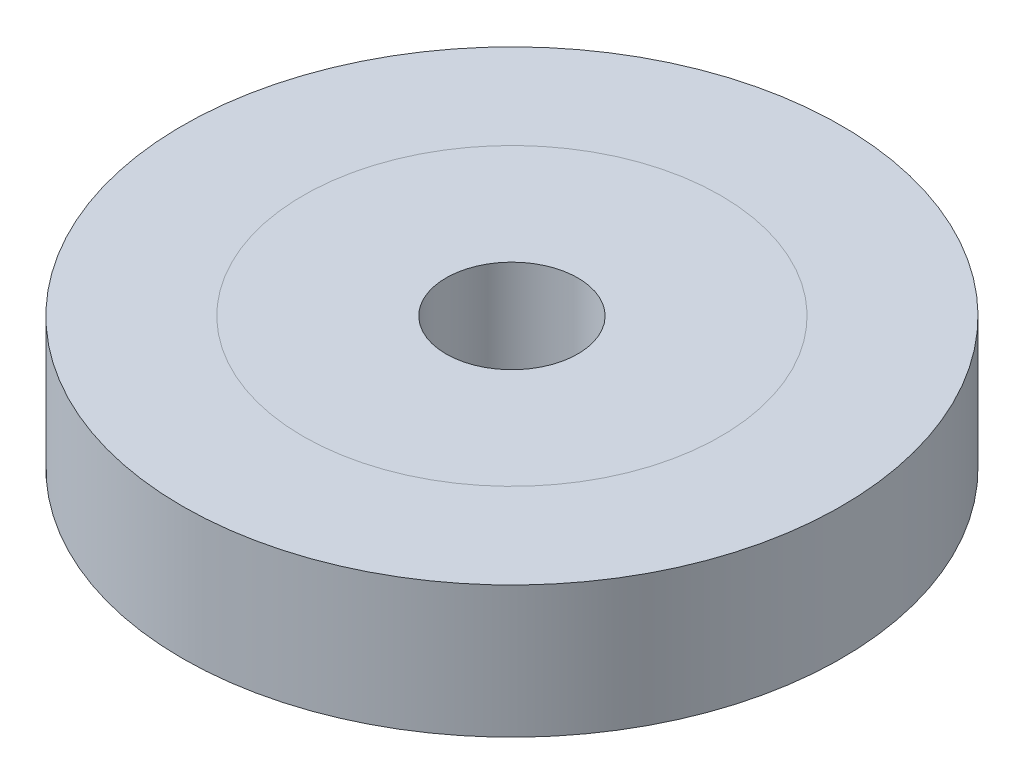
ISO-10303-21;
HEADER;
FILE_DESCRIPTION(('STEP AP214'),'2;1');
FILE_NAME('part.step','',(''),(''),'','','');
FILE_SCHEMA(('AUTOMOTIVE_DESIGN { 1 0 10303 214 1 1 1 1 }'));
ENDSEC;
DATA;
#1=APPLICATION_CONTEXT('core data for automotive mechanical design processes');
#2=APPLICATION_PROTOCOL_DEFINITION('international standard','automotive_design',2000,#1);
#3=PRODUCT_CONTEXT('',#1,'mechanical');
#4=PRODUCT('Part','Part','',(#3));
#5=PRODUCT_RELATED_PRODUCT_CATEGORY('part','',(#4));
#6=PRODUCT_DEFINITION_FORMATION('','',#4);
#7=PRODUCT_DEFINITION_CONTEXT('part definition',#1,'design');
#8=PRODUCT_DEFINITION('design','',#6,#7);
#9=PRODUCT_DEFINITION_SHAPE('','',#8);
#10=(LENGTH_UNIT() NAMED_UNIT(*) SI_UNIT(.MILLI.,.METRE.));
#11=(NAMED_UNIT(*) PLANE_ANGLE_UNIT() SI_UNIT($,.RADIAN.));
#12=(NAMED_UNIT(*) SI_UNIT($,.STERADIAN.) SOLID_ANGLE_UNIT());
#13=UNCERTAINTY_MEASURE_WITH_UNIT(LENGTH_MEASURE(1.E-05),#10,'distance_accuracy_value','');
#14=(GEOMETRIC_REPRESENTATION_CONTEXT(3) GLOBAL_UNCERTAINTY_ASSIGNED_CONTEXT((#13)) GLOBAL_UNIT_ASSIGNED_CONTEXT((#10,
#11,#12)) REPRESENTATION_CONTEXT('',''));
#15=CARTESIAN_POINT('',(0.,0.,0.));
#16=DIRECTION('',(0.,0.,1.));
#17=DIRECTION('',(1.,0.,0.));
#18=AXIS2_PLACEMENT_3D('',#15,#16,#17);
#19=CARTESIAN_POINT('',(0.,3.,0.));
#20=DIRECTION('',(0.,1.,0.));
#21=DIRECTION('',(0.,0.,1.));
#22=AXIS2_PLACEMENT_3D('',#19,#20,#21);
#23=PLANE('',#22);
#24=CARTESIAN_POINT('',(0.,3.,0.));
#25=DIRECTION('',(0.,1.,0.));
#26=DIRECTION('',(0.,0.,1.));
#27=AXIS2_PLACEMENT_3D('',#24,#25,#26);
#28=CIRCLE('',#27,15.);
#29=CARTESIAN_POINT('',(0.,3.,15.));
#30=VERTEX_POINT('',#29);
#31=EDGE_CURVE('E11',#30,#30,#28,.T.);
#32=ORIENTED_EDGE('',*,*,#31,.T.);
#33=EDGE_LOOP('',(#32));
#34=FACE_BOUND('',#33,.T.);
#35=CARTESIAN_POINT('',(0.,3.,0.));
#36=DIRECTION('',(0.,1.,0.));
#37=DIRECTION('',(0.,0.,1.));
#38=AXIS2_PLACEMENT_3D('',#35,#36,#37);
#39=CIRCLE('',#38,9.5);
#40=CARTESIAN_POINT('',(0.,3.,9.5));
#41=VERTEX_POINT('',#40);
#42=EDGE_CURVE('E54',#41,#41,#39,.T.);
#43=ORIENTED_EDGE('',*,*,#42,.F.);
#44=EDGE_LOOP('',(#43));
#45=FACE_BOUND('',#44,.T.);
#46=ADVANCED_FACE('F43',(#34,#45),#23,.T.);
#47=CARTESIAN_POINT('',(0.,-3.,0.));
#48=DIRECTION('',(0.,1.,0.));
#49=DIRECTION('',(0.,0.,1.));
#50=AXIS2_PLACEMENT_3D('',#47,#48,#49);
#51=PLANE('',#50);
#52=CARTESIAN_POINT('',(0.,-3.,0.));
#53=DIRECTION('',(0.,1.,0.));
#54=DIRECTION('',(0.,0.,1.));
#55=AXIS2_PLACEMENT_3D('',#52,#53,#54);
#56=CIRCLE('',#55,15.);
#57=CARTESIAN_POINT('',(0.,-3.,15.));
#58=VERTEX_POINT('',#57);
#59=EDGE_CURVE('E47',#58,#58,#56,.T.);
#60=ORIENTED_EDGE('',*,*,#59,.F.);
#61=EDGE_LOOP('',(#60));
#62=FACE_BOUND('',#61,.T.);
#63=CARTESIAN_POINT('',(0.,-3.,0.));
#64=DIRECTION('',(0.,1.,0.));
#65=DIRECTION('',(0.,0.,1.));
#66=AXIS2_PLACEMENT_3D('',#63,#64,#65);
#67=CIRCLE('',#66,9.5);
#68=CARTESIAN_POINT('',(0.,-3.,9.5));
#69=VERTEX_POINT('',#68);
#70=EDGE_CURVE('E56',#69,#69,#67,.T.);
#71=ORIENTED_EDGE('',*,*,#70,.T.);
#72=EDGE_LOOP('',(#71));
#73=FACE_BOUND('',#72,.T.);
#74=ADVANCED_FACE('F66',(#62,#73),#51,.F.);
#75=CARTESIAN_POINT('',(0.,3.,0.));
#76=DIRECTION('',(0.,-1.,0.));
#77=DIRECTION('',(0.,0.,-1.));
#78=AXIS2_PLACEMENT_3D('',#75,#76,#77);
#79=CYLINDRICAL_SURFACE('',#78,15.);
#80=ORIENTED_EDGE('',*,*,#31,.F.);
#81=EDGE_LOOP('',(#80));
#82=FACE_BOUND('',#81,.T.);
#83=ORIENTED_EDGE('',*,*,#59,.T.);
#84=EDGE_LOOP('',(#83));
#85=FACE_BOUND('',#84,.T.);
#86=ADVANCED_FACE('F45',(#82,#85),#79,.T.);
#87=CARTESIAN_POINT('',(0.,3.,0.));
#88=DIRECTION('',(0.,-1.,0.));
#89=DIRECTION('',(0.,0.,-1.));
#90=AXIS2_PLACEMENT_3D('',#87,#88,#89);
#91=CYLINDRICAL_SURFACE('',#90,9.5);
#92=ORIENTED_EDGE('',*,*,#42,.T.);
#93=EDGE_LOOP('',(#92));
#94=FACE_BOUND('',#93,.T.);
#95=ORIENTED_EDGE('',*,*,#70,.F.);
#96=EDGE_LOOP('',(#95));
#97=FACE_BOUND('',#96,.T.);
#98=ADVANCED_FACE('F62',(#94,#97),#91,.F.);
#99=CLOSED_SHELL('',(#46,#74,#86,#98));
#100=MANIFOLD_SOLID_BREP('B2',#99);
#101=CARTESIAN_POINT('',(0.,3.,0.));
#102=DIRECTION('',(0.,1.,0.));
#103=DIRECTION('',(0.,0.,1.));
#104=AXIS2_PLACEMENT_3D('',#101,#102,#103);
#105=PLANE('',#104);
#106=CARTESIAN_POINT('',(0.,3.,0.));
#107=DIRECTION('',(0.,1.,0.));
#108=DIRECTION('',(0.,0.,1.));
#109=AXIS2_PLACEMENT_3D('',#106,#107,#108);
#110=CIRCLE('',#109,9.5);
#111=CARTESIAN_POINT('',(0.,3.,9.5));
#112=VERTEX_POINT('',#111);
#113=EDGE_CURVE('E42',#112,#112,#110,.T.);
#114=ORIENTED_EDGE('',*,*,#113,.T.);
#115=EDGE_LOOP('',(#114));
#116=FACE_BOUND('',#115,.T.);
#117=CARTESIAN_POINT('',(0.,3.,0.));
#118=DIRECTION('',(0.,1.,0.));
#119=DIRECTION('',(0.,0.,1.));
#120=AXIS2_PLACEMENT_3D('',#117,#118,#119);
#121=CIRCLE('',#120,3.);
#122=CARTESIAN_POINT('',(0.,3.,3.));
#123=VERTEX_POINT('',#122);
#124=EDGE_CURVE('E116',#123,#123,#121,.T.);
#125=ORIENTED_EDGE('',*,*,#124,.F.);
#126=EDGE_LOOP('',(#125));
#127=FACE_BOUND('',#126,.T.);
#128=ADVANCED_FACE('F105',(#116,#127),#105,.T.);
#129=CARTESIAN_POINT('',(0.,-3.,0.));
#130=DIRECTION('',(0.,1.,0.));
#131=DIRECTION('',(0.,0.,1.));
#132=AXIS2_PLACEMENT_3D('',#129,#130,#131);
#133=PLANE('',#132);
#134=CARTESIAN_POINT('',(0.,-3.,0.));
#135=DIRECTION('',(0.,1.,0.));
#136=DIRECTION('',(0.,0.,1.));
#137=AXIS2_PLACEMENT_3D('',#134,#135,#136);
#138=CIRCLE('',#137,9.5);
#139=CARTESIAN_POINT('',(0.,-3.,9.5));
#140=VERTEX_POINT('',#139);
#141=EDGE_CURVE('E109',#140,#140,#138,.T.);
#142=ORIENTED_EDGE('',*,*,#141,.F.);
#143=EDGE_LOOP('',(#142));
#144=FACE_BOUND('',#143,.T.);
#145=CARTESIAN_POINT('',(0.,-3.,0.));
#146=DIRECTION('',(0.,1.,0.));
#147=DIRECTION('',(0.,0.,1.));
#148=AXIS2_PLACEMENT_3D('',#145,#146,#147);
#149=CIRCLE('',#148,3.);
#150=CARTESIAN_POINT('',(0.,-3.,3.));
#151=VERTEX_POINT('',#150);
#152=EDGE_CURVE('E118',#151,#151,#149,.T.);
#153=ORIENTED_EDGE('',*,*,#152,.T.);
#154=EDGE_LOOP('',(#153));
#155=FACE_BOUND('',#154,.T.);
#156=ADVANCED_FACE('F128',(#144,#155),#133,.F.);
#157=CARTESIAN_POINT('',(0.,3.,0.));
#158=DIRECTION('',(0.,-1.,0.));
#159=DIRECTION('',(0.,0.,-1.));
#160=AXIS2_PLACEMENT_3D('',#157,#158,#159);
#161=CYLINDRICAL_SURFACE('',#160,9.5);
#162=ORIENTED_EDGE('',*,*,#113,.F.);
#163=EDGE_LOOP('',(#162));
#164=FACE_BOUND('',#163,.T.);
#165=ORIENTED_EDGE('',*,*,#141,.T.);
#166=EDGE_LOOP('',(#165));
#167=FACE_BOUND('',#166,.T.);
#168=ADVANCED_FACE('F107',(#164,#167),#161,.T.);
#169=CARTESIAN_POINT('',(0.,3.,0.));
#170=DIRECTION('',(0.,-1.,0.));
#171=DIRECTION('',(0.,0.,-1.));
#172=AXIS2_PLACEMENT_3D('',#169,#170,#171);
#173=CYLINDRICAL_SURFACE('',#172,3.);
#174=ORIENTED_EDGE('',*,*,#124,.T.);
#175=EDGE_LOOP('',(#174));
#176=FACE_BOUND('',#175,.T.);
#177=ORIENTED_EDGE('',*,*,#152,.F.);
#178=EDGE_LOOP('',(#177));
#179=FACE_BOUND('',#178,.T.);
#180=ADVANCED_FACE('F124',(#176,#179),#173,.F.);
#181=CLOSED_SHELL('',(#128,#156,#168,#180));
#182=MANIFOLD_SOLID_BREP('B6',#181);
#183=ADVANCED_BREP_SHAPE_REPRESENTATION('',(#18,#100,#182),#14);
#184=SHAPE_DEFINITION_REPRESENTATION(#9,#183);
ENDSEC;
END-ISO-10303-21;
